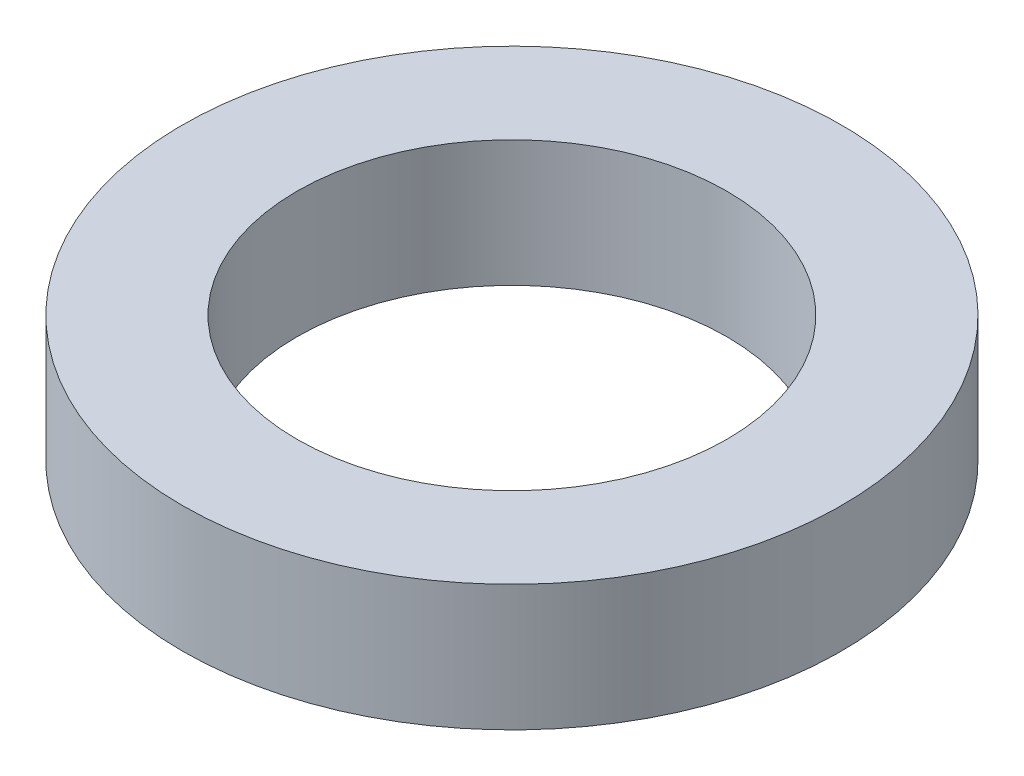
ISO-10303-21;
HEADER;
FILE_DESCRIPTION(('STEP AP214'),'2;1');
FILE_NAME('part.step','',(''),(''),'','','');
FILE_SCHEMA(('AUTOMOTIVE_DESIGN { 1 0 10303 214 1 1 1 1 }'));
ENDSEC;
DATA;
#1=APPLICATION_CONTEXT('core data for automotive mechanical design processes');
#2=APPLICATION_PROTOCOL_DEFINITION('international standard','automotive_design',2000,#1);
#3=PRODUCT_CONTEXT('',#1,'mechanical');
#4=PRODUCT('Part','Part','',(#3));
#5=PRODUCT_RELATED_PRODUCT_CATEGORY('part','',(#4));
#6=PRODUCT_DEFINITION_FORMATION('','',#4);
#7=PRODUCT_DEFINITION_CONTEXT('part definition',#1,'design');
#8=PRODUCT_DEFINITION('design','',#6,#7);
#9=PRODUCT_DEFINITION_SHAPE('','',#8);
#10=(LENGTH_UNIT() NAMED_UNIT(*) SI_UNIT(.MILLI.,.METRE.));
#11=(NAMED_UNIT(*) PLANE_ANGLE_UNIT() SI_UNIT($,.RADIAN.));
#12=(NAMED_UNIT(*) SI_UNIT($,.STERADIAN.) SOLID_ANGLE_UNIT());
#13=UNCERTAINTY_MEASURE_WITH_UNIT(LENGTH_MEASURE(1.E-05),#10,'distance_accuracy_value','');
#14=(GEOMETRIC_REPRESENTATION_CONTEXT(3) GLOBAL_UNCERTAINTY_ASSIGNED_CONTEXT((#13)) GLOBAL_UNIT_ASSIGNED_CONTEXT((#10,
#11,#12)) REPRESENTATION_CONTEXT('',''));
#15=CARTESIAN_POINT('',(0.,0.,0.));
#16=DIRECTION('',(0.,0.,1.));
#17=DIRECTION('',(1.,0.,0.));
#18=AXIS2_PLACEMENT_3D('',#15,#16,#17);
#19=CARTESIAN_POINT('',(0.,22.,0.));
#20=DIRECTION('',(0.,-1.,0.));
#21=DIRECTION('',(0.,0.,-1.));
#22=AXIS2_PLACEMENT_3D('',#19,#20,#21);
#23=CYLINDRICAL_SURFACE('',#22,57.5);
#24=CARTESIAN_POINT('',(0.,22.,0.));
#25=DIRECTION('',(0.,1.,0.));
#26=DIRECTION('',(0.,0.,1.));
#27=AXIS2_PLACEMENT_3D('',#24,#25,#26);
#28=CIRCLE('',#27,57.5);
#29=CARTESIAN_POINT('',(0.,22.,57.5));
#30=VERTEX_POINT('',#29);
#31=EDGE_CURVE('E10',#30,#30,#28,.T.);
#32=ORIENTED_EDGE('',*,*,#31,.F.);
#33=EDGE_LOOP('',(#32));
#34=FACE_BOUND('',#33,.T.);
#35=CARTESIAN_POINT('',(0.,0.,0.));
#36=DIRECTION('',(0.,1.,0.));
#37=DIRECTION('',(0.,0.,1.));
#38=AXIS2_PLACEMENT_3D('',#35,#36,#37);
#39=CIRCLE('',#38,57.5);
#40=CARTESIAN_POINT('',(0.,0.,57.5));
#41=VERTEX_POINT('',#40);
#42=EDGE_CURVE('E37',#41,#41,#39,.T.);
#43=ORIENTED_EDGE('',*,*,#42,.T.);
#44=EDGE_LOOP('',(#43));
#45=FACE_BOUND('',#44,.T.);
#46=ADVANCED_FACE('F40',(#34,#45),#23,.T.);
#47=CARTESIAN_POINT('',(0.,22.,0.));
#48=DIRECTION('',(0.,1.,0.));
#49=DIRECTION('',(0.,0.,1.));
#50=AXIS2_PLACEMENT_3D('',#47,#48,#49);
#51=PLANE('',#50);
#52=CARTESIAN_POINT('',(0.,22.,0.));
#53=DIRECTION('',(0.,1.,0.));
#54=DIRECTION('',(0.,0.,1.));
#55=AXIS2_PLACEMENT_3D('',#52,#53,#54);
#56=CIRCLE('',#55,37.5);
#57=CARTESIAN_POINT('',(0.,22.,37.5));
#58=VERTEX_POINT('',#57);
#59=EDGE_CURVE('E50',#58,#58,#56,.T.);
#60=ORIENTED_EDGE('',*,*,#59,.F.);
#61=EDGE_LOOP('',(#60));
#62=FACE_BOUND('',#61,.T.);
#63=ORIENTED_EDGE('',*,*,#31,.T.);
#64=EDGE_LOOP('',(#63));
#65=FACE_BOUND('',#64,.T.);
#66=ADVANCED_FACE('F59',(#62,#65),#51,.T.);
#67=CARTESIAN_POINT('',(0.,0.,0.));
#68=DIRECTION('',(0.,1.,0.));
#69=DIRECTION('',(0.,0.,1.));
#70=AXIS2_PLACEMENT_3D('',#67,#68,#69);
#71=PLANE('',#70);
#72=CARTESIAN_POINT('',(0.,0.,0.));
#73=DIRECTION('',(0.,1.,0.));
#74=DIRECTION('',(0.,0.,1.));
#75=AXIS2_PLACEMENT_3D('',#72,#73,#74);
#76=CIRCLE('',#75,37.5);
#77=CARTESIAN_POINT('',(0.,0.,37.5));
#78=VERTEX_POINT('',#77);
#79=EDGE_CURVE('E47',#78,#78,#76,.T.);
#80=ORIENTED_EDGE('',*,*,#79,.T.);
#81=EDGE_LOOP('',(#80));
#82=FACE_BOUND('',#81,.T.);
#83=ORIENTED_EDGE('',*,*,#42,.F.);
#84=EDGE_LOOP('',(#83));
#85=FACE_BOUND('',#84,.T.);
#86=ADVANCED_FACE('F58',(#82,#85),#71,.F.);
#87=CARTESIAN_POINT('',(0.,22.,0.));
#88=DIRECTION('',(0.,-1.,0.));
#89=DIRECTION('',(0.,0.,-1.));
#90=AXIS2_PLACEMENT_3D('',#87,#88,#89);
#91=CYLINDRICAL_SURFACE('',#90,37.5);
#92=ORIENTED_EDGE('',*,*,#59,.T.);
#93=EDGE_LOOP('',(#92));
#94=FACE_BOUND('',#93,.T.);
#95=ORIENTED_EDGE('',*,*,#79,.F.);
#96=EDGE_LOOP('',(#95));
#97=FACE_BOUND('',#96,.T.);
#98=ADVANCED_FACE('F54',(#94,#97),#91,.F.);
#99=CLOSED_SHELL('',(#46,#66,#86,#98));
#100=MANIFOLD_SOLID_BREP('B2',#99);
#101=ADVANCED_BREP_SHAPE_REPRESENTATION('',(#18,#100),#14);
#102=SHAPE_DEFINITION_REPRESENTATION(#9,#101);
ENDSEC;
END-ISO-10303-21;
